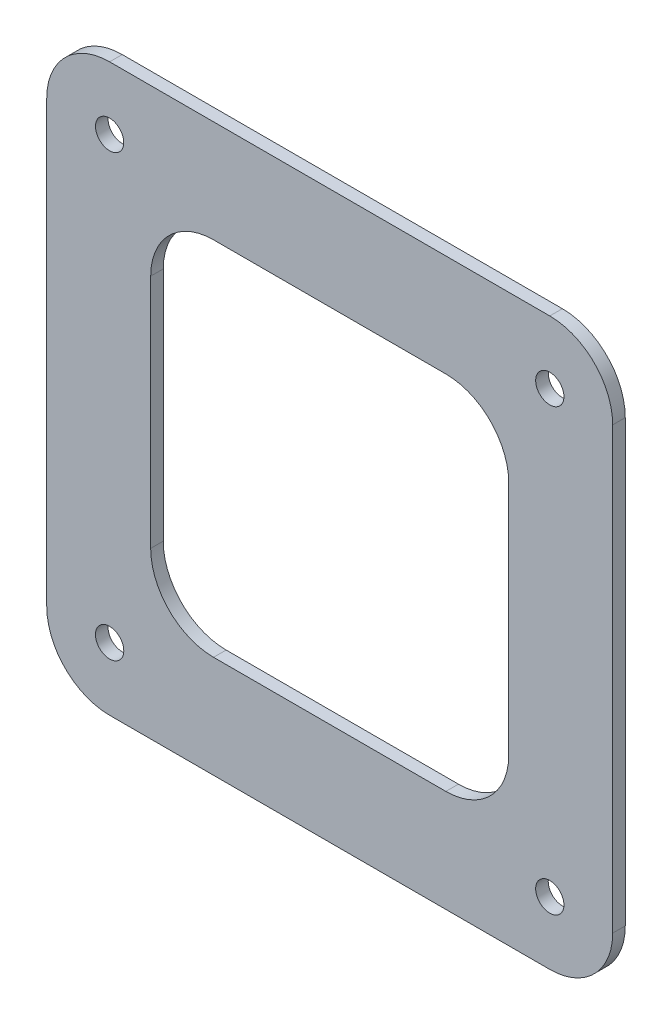
ISO-10303-21;
HEADER;
FILE_DESCRIPTION(('STEP AP214'),'2;1');
FILE_NAME('part.step','',(''),(''),'','','');
FILE_SCHEMA(('AUTOMOTIVE_DESIGN { 1 0 10303 214 1 1 1 1 }'));
ENDSEC;
DATA;
#1=APPLICATION_CONTEXT('core data for automotive mechanical design processes');
#2=APPLICATION_PROTOCOL_DEFINITION('international standard','automotive_design',2000,#1);
#3=PRODUCT_CONTEXT('',#1,'mechanical');
#4=PRODUCT('Part','Part','',(#3));
#5=PRODUCT_RELATED_PRODUCT_CATEGORY('part','',(#4));
#6=PRODUCT_DEFINITION_FORMATION('','',#4);
#7=PRODUCT_DEFINITION_CONTEXT('part definition',#1,'design');
#8=PRODUCT_DEFINITION('design','',#6,#7);
#9=PRODUCT_DEFINITION_SHAPE('','',#8);
#10=(LENGTH_UNIT() NAMED_UNIT(*) SI_UNIT(.MILLI.,.METRE.));
#11=(NAMED_UNIT(*) PLANE_ANGLE_UNIT() SI_UNIT($,.RADIAN.));
#12=(NAMED_UNIT(*) SI_UNIT($,.STERADIAN.) SOLID_ANGLE_UNIT());
#13=UNCERTAINTY_MEASURE_WITH_UNIT(LENGTH_MEASURE(1.E-05),#10,'distance_accuracy_value','');
#14=(GEOMETRIC_REPRESENTATION_CONTEXT(3) GLOBAL_UNCERTAINTY_ASSIGNED_CONTEXT((#13)) GLOBAL_UNIT_ASSIGNED_CONTEXT((#10,
#11,#12)) REPRESENTATION_CONTEXT('',''));
#15=CARTESIAN_POINT('',(0.,0.,0.));
#16=DIRECTION('',(0.,0.,1.));
#17=DIRECTION('',(1.,0.,0.));
#18=AXIS2_PLACEMENT_3D('',#15,#16,#17);
#19=CARTESIAN_POINT('',(35.,35.,2.));
#20=DIRECTION('',(0.,0.,-1.));
#21=DIRECTION('',(-1.,0.,0.));
#22=AXIS2_PLACEMENT_3D('',#19,#20,#21);
#23=CYLINDRICAL_SURFACE('',#22,10.);
#24=CARTESIAN_POINT('',(35.,35.,0.));
#25=DIRECTION('',(0.,0.,1.));
#26=DIRECTION('',(1.,0.,0.));
#27=AXIS2_PLACEMENT_3D('',#24,#25,#26);
#28=CIRCLE('',#27,10.);
#29=CARTESIAN_POINT('',(45.,34.9999999999999,0.));
#30=VERTEX_POINT('',#29);
#31=CARTESIAN_POINT('',(35.,45.,0.));
#32=VERTEX_POINT('',#31);
#33=EDGE_CURVE('E230',#30,#32,#28,.T.);
#34=ORIENTED_EDGE('',*,*,#33,.T.);
#35=DIRECTION('',(0.,0.,-1.));
#36=VECTOR('',#35,1.);
#37=CARTESIAN_POINT('',(35.,45.,2.));
#38=LINE('',#37,#36);
#39=CARTESIAN_POINT('',(35.,45.,2.));
#40=VERTEX_POINT('',#39);
#41=EDGE_CURVE('E11',#40,#32,#38,.T.);
#42=ORIENTED_EDGE('',*,*,#41,.F.);
#43=CARTESIAN_POINT('',(35.,35.,2.));
#44=DIRECTION('',(0.,0.,1.));
#45=DIRECTION('',(1.,0.,0.));
#46=AXIS2_PLACEMENT_3D('',#43,#44,#45);
#47=CIRCLE('',#46,10.);
#48=CARTESIAN_POINT('',(45.,34.9999999999999,2.));
#49=VERTEX_POINT('',#48);
#50=EDGE_CURVE('E233',#49,#40,#47,.T.);
#51=ORIENTED_EDGE('',*,*,#50,.F.);
#52=DIRECTION('',(0.,0.,-1.));
#53=VECTOR('',#52,1.);
#54=CARTESIAN_POINT('',(45.,34.9999999999999,2.));
#55=LINE('',#54,#53);
#56=EDGE_CURVE('E251',#49,#30,#55,.T.);
#57=ORIENTED_EDGE('',*,*,#56,.T.);
#58=EDGE_LOOP('',(#34,#42,#51,#57));
#59=FACE_BOUND('',#58,.T.);
#60=ADVANCED_FACE('F32',(#59),#23,.T.);
#61=CARTESIAN_POINT('',(35.,45.,2.));
#62=DIRECTION('',(0.,-1.,0.));
#63=DIRECTION('',(1.,0.,0.));
#64=AXIS2_PLACEMENT_3D('',#61,#62,#63);
#65=PLANE('',#64);
#66=DIRECTION('',(-1.,0.,0.));
#67=VECTOR('',#66,1.);
#68=CARTESIAN_POINT('',(35.,45.,0.));
#69=LINE('',#68,#67);
#70=CARTESIAN_POINT('',(-34.9999999999999,45.,0.));
#71=VERTEX_POINT('',#70);
#72=EDGE_CURVE('E254',#32,#71,#69,.T.);
#73=ORIENTED_EDGE('',*,*,#72,.T.);
#74=DIRECTION('',(0.,0.,-1.));
#75=VECTOR('',#74,1.);
#76=CARTESIAN_POINT('',(-34.9999999999999,45.,2.));
#77=LINE('',#76,#75);
#78=CARTESIAN_POINT('',(-34.9999999999999,45.,2.));
#79=VERTEX_POINT('',#78);
#80=EDGE_CURVE('E39',#79,#71,#77,.T.);
#81=ORIENTED_EDGE('',*,*,#80,.F.);
#82=DIRECTION('',(-1.,0.,0.));
#83=VECTOR('',#82,1.);
#84=CARTESIAN_POINT('',(35.,45.,2.));
#85=LINE('',#84,#83);
#86=EDGE_CURVE('E236',#40,#79,#85,.T.);
#87=ORIENTED_EDGE('',*,*,#86,.F.);
#88=ORIENTED_EDGE('',*,*,#41,.T.);
#89=EDGE_LOOP('',(#73,#81,#87,#88));
#90=FACE_BOUND('',#89,.T.);
#91=ADVANCED_FACE('F310',(#90),#65,.F.);
#92=CARTESIAN_POINT('',(-35.,35.,2.));
#93=DIRECTION('',(0.,0.,-1.));
#94=DIRECTION('',(-1.,0.,0.));
#95=AXIS2_PLACEMENT_3D('',#92,#93,#94);
#96=CYLINDRICAL_SURFACE('',#95,10.);
#97=CARTESIAN_POINT('',(-35.,35.,0.));
#98=DIRECTION('',(0.,0.,1.));
#99=DIRECTION('',(1.,0.,0.));
#100=AXIS2_PLACEMENT_3D('',#97,#98,#99);
#101=CIRCLE('',#100,10.);
#102=CARTESIAN_POINT('',(-45.,34.9999999999999,0.));
#103=VERTEX_POINT('',#102);
#104=EDGE_CURVE('E256',#71,#103,#101,.T.);
#105=ORIENTED_EDGE('',*,*,#104,.T.);
#106=DIRECTION('',(0.,0.,-1.));
#107=VECTOR('',#106,1.);
#108=CARTESIAN_POINT('',(-45.,34.9999999999999,2.));
#109=LINE('',#108,#107);
#110=CARTESIAN_POINT('',(-45.,34.9999999999999,2.));
#111=VERTEX_POINT('',#110);
#112=EDGE_CURVE('E281',#111,#103,#109,.T.);
#113=ORIENTED_EDGE('',*,*,#112,.F.);
#114=CARTESIAN_POINT('',(-35.,35.,2.));
#115=DIRECTION('',(0.,0.,1.));
#116=DIRECTION('',(1.,0.,0.));
#117=AXIS2_PLACEMENT_3D('',#114,#115,#116);
#118=CIRCLE('',#117,10.);
#119=EDGE_CURVE('E239',#79,#111,#118,.T.);
#120=ORIENTED_EDGE('',*,*,#119,.F.);
#121=ORIENTED_EDGE('',*,*,#80,.T.);
#122=EDGE_LOOP('',(#105,#113,#120,#121));
#123=FACE_BOUND('',#122,.T.);
#124=ADVANCED_FACE('F288',(#123),#96,.T.);
#125=CARTESIAN_POINT('',(-45.,-35.,2.));
#126=DIRECTION('',(1.,0.,0.));
#127=DIRECTION('',(0.,0.,-1.));
#128=AXIS2_PLACEMENT_3D('',#125,#126,#127);
#129=PLANE('',#128);
#130=DIRECTION('',(0.,-1.,0.));
#131=VECTOR('',#130,1.);
#132=CARTESIAN_POINT('',(-45.,-35.,0.));
#133=LINE('',#132,#131);
#134=CARTESIAN_POINT('',(-45.,-35.,0.));
#135=VERTEX_POINT('',#134);
#136=EDGE_CURVE('E258',#103,#135,#133,.T.);
#137=ORIENTED_EDGE('',*,*,#136,.T.);
#138=DIRECTION('',(0.,0.,-1.));
#139=VECTOR('',#138,1.);
#140=CARTESIAN_POINT('',(-45.,-35.,2.));
#141=LINE('',#140,#139);
#142=CARTESIAN_POINT('',(-45.,-35.,2.));
#143=VERTEX_POINT('',#142);
#144=EDGE_CURVE('E278',#143,#135,#141,.T.);
#145=ORIENTED_EDGE('',*,*,#144,.F.);
#146=DIRECTION('',(0.,-1.,0.));
#147=VECTOR('',#146,1.);
#148=CARTESIAN_POINT('',(-45.,-35.,2.));
#149=LINE('',#148,#147);
#150=EDGE_CURVE('E241',#111,#143,#149,.T.);
#151=ORIENTED_EDGE('',*,*,#150,.F.);
#152=ORIENTED_EDGE('',*,*,#112,.T.);
#153=EDGE_LOOP('',(#137,#145,#151,#152));
#154=FACE_BOUND('',#153,.T.);
#155=ADVANCED_FACE('F298',(#154),#129,.F.);
#156=CARTESIAN_POINT('',(-35.,-35.,2.));
#157=DIRECTION('',(0.,0.,-1.));
#158=DIRECTION('',(-1.,0.,0.));
#159=AXIS2_PLACEMENT_3D('',#156,#157,#158);
#160=CYLINDRICAL_SURFACE('',#159,10.);
#161=CARTESIAN_POINT('',(-35.,-35.,0.));
#162=DIRECTION('',(0.,0.,1.));
#163=DIRECTION('',(-1.,0.,0.));
#164=AXIS2_PLACEMENT_3D('',#161,#162,#163);
#165=CIRCLE('',#164,10.);
#166=CARTESIAN_POINT('',(-34.9999999999999,-45.,0.));
#167=VERTEX_POINT('',#166);
#168=EDGE_CURVE('E260',#135,#167,#165,.T.);
#169=ORIENTED_EDGE('',*,*,#168,.T.);
#170=DIRECTION('',(0.,0.,-1.));
#171=VECTOR('',#170,1.);
#172=CARTESIAN_POINT('',(-34.9999999999999,-45.,2.));
#173=LINE('',#172,#171);
#174=CARTESIAN_POINT('',(-34.9999999999999,-45.,2.));
#175=VERTEX_POINT('',#174);
#176=EDGE_CURVE('E275',#175,#167,#173,.T.);
#177=ORIENTED_EDGE('',*,*,#176,.F.);
#178=CARTESIAN_POINT('',(-35.,-35.,2.));
#179=DIRECTION('',(0.,0.,1.));
#180=DIRECTION('',(-1.,0.,0.));
#181=AXIS2_PLACEMENT_3D('',#178,#179,#180);
#182=CIRCLE('',#181,10.);
#183=EDGE_CURVE('E243',#143,#175,#182,.T.);
#184=ORIENTED_EDGE('',*,*,#183,.F.);
#185=ORIENTED_EDGE('',*,*,#144,.T.);
#186=EDGE_LOOP('',(#169,#177,#184,#185));
#187=FACE_BOUND('',#186,.T.);
#188=ADVANCED_FACE('F302',(#187),#160,.T.);
#189=CARTESIAN_POINT('',(35.,-45.,2.));
#190=DIRECTION('',(0.,1.,0.));
#191=DIRECTION('',(-1.,0.,0.));
#192=AXIS2_PLACEMENT_3D('',#189,#190,#191);
#193=PLANE('',#192);
#194=DIRECTION('',(1.,0.,0.));
#195=VECTOR('',#194,1.);
#196=CARTESIAN_POINT('',(35.,-45.,0.));
#197=LINE('',#196,#195);
#198=CARTESIAN_POINT('',(35.,-45.,0.));
#199=VERTEX_POINT('',#198);
#200=EDGE_CURVE('E262',#167,#199,#197,.T.);
#201=ORIENTED_EDGE('',*,*,#200,.T.);
#202=DIRECTION('',(0.,0.,-1.));
#203=VECTOR('',#202,1.);
#204=CARTESIAN_POINT('',(35.,-45.,2.));
#205=LINE('',#204,#203);
#206=CARTESIAN_POINT('',(35.,-45.,2.));
#207=VERTEX_POINT('',#206);
#208=EDGE_CURVE('E272',#207,#199,#205,.T.);
#209=ORIENTED_EDGE('',*,*,#208,.F.);
#210=DIRECTION('',(1.,0.,0.));
#211=VECTOR('',#210,1.);
#212=CARTESIAN_POINT('',(35.,-45.,2.));
#213=LINE('',#212,#211);
#214=EDGE_CURVE('E245',#175,#207,#213,.T.);
#215=ORIENTED_EDGE('',*,*,#214,.F.);
#216=ORIENTED_EDGE('',*,*,#176,.T.);
#217=EDGE_LOOP('',(#201,#209,#215,#216));
#218=FACE_BOUND('',#217,.T.);
#219=ADVANCED_FACE('F323',(#218),#193,.F.);
#220=CARTESIAN_POINT('',(35.,-35.,2.));
#221=DIRECTION('',(0.,0.,-1.));
#222=DIRECTION('',(-1.,0.,0.));
#223=AXIS2_PLACEMENT_3D('',#220,#221,#222);
#224=CYLINDRICAL_SURFACE('',#223,10.);
#225=CARTESIAN_POINT('',(35.,-35.,0.));
#226=DIRECTION('',(0.,0.,1.));
#227=DIRECTION('',(-1.,0.,0.));
#228=AXIS2_PLACEMENT_3D('',#225,#226,#227);
#229=CIRCLE('',#228,10.);
#230=CARTESIAN_POINT('',(45.,-34.9999999999999,0.));
#231=VERTEX_POINT('',#230);
#232=EDGE_CURVE('E264',#199,#231,#229,.T.);
#233=ORIENTED_EDGE('',*,*,#232,.T.);
#234=DIRECTION('',(0.,0.,-1.));
#235=VECTOR('',#234,1.);
#236=CARTESIAN_POINT('',(45.,-34.9999999999999,2.));
#237=LINE('',#236,#235);
#238=CARTESIAN_POINT('',(45.,-34.9999999999999,2.));
#239=VERTEX_POINT('',#238);
#240=EDGE_CURVE('E269',#239,#231,#237,.T.);
#241=ORIENTED_EDGE('',*,*,#240,.F.);
#242=CARTESIAN_POINT('',(35.,-35.,2.));
#243=DIRECTION('',(0.,0.,1.));
#244=DIRECTION('',(-1.,0.,0.));
#245=AXIS2_PLACEMENT_3D('',#242,#243,#244);
#246=CIRCLE('',#245,10.);
#247=EDGE_CURVE('E247',#207,#239,#246,.T.);
#248=ORIENTED_EDGE('',*,*,#247,.F.);
#249=ORIENTED_EDGE('',*,*,#208,.T.);
#250=EDGE_LOOP('',(#233,#241,#248,#249));
#251=FACE_BOUND('',#250,.T.);
#252=ADVANCED_FACE('F321',(#251),#224,.T.);
#253=CARTESIAN_POINT('',(45.,-34.9999999999999,2.));
#254=DIRECTION('',(-1.,0.,0.));
#255=DIRECTION('',(0.,0.,1.));
#256=AXIS2_PLACEMENT_3D('',#253,#254,#255);
#257=PLANE('',#256);
#258=DIRECTION('',(0.,1.,0.));
#259=VECTOR('',#258,1.);
#260=CARTESIAN_POINT('',(45.,-34.9999999999999,0.));
#261=LINE('',#260,#259);
#262=EDGE_CURVE('E237',#231,#30,#261,.T.);
#263=ORIENTED_EDGE('',*,*,#262,.T.);
#264=ORIENTED_EDGE('',*,*,#56,.F.);
#265=DIRECTION('',(0.,1.,0.));
#266=VECTOR('',#265,1.);
#267=CARTESIAN_POINT('',(45.,-34.9999999999999,2.));
#268=LINE('',#267,#266);
#269=EDGE_CURVE('E249',#239,#49,#268,.T.);
#270=ORIENTED_EDGE('',*,*,#269,.F.);
#271=ORIENTED_EDGE('',*,*,#240,.T.);
#272=EDGE_LOOP('',(#263,#264,#270,#271));
#273=FACE_BOUND('',#272,.T.);
#274=ADVANCED_FACE('F316',(#273),#257,.F.);
#275=CARTESIAN_POINT('',(35.,35.,2.));
#276=DIRECTION('',(0.,0.,1.));
#277=DIRECTION('',(1.,0.,0.));
#278=AXIS2_PLACEMENT_3D('',#275,#276,#277);
#279=PLANE('',#278);
#280=CARTESIAN_POINT('',(-18.4714638136957,18.7452278888274,2.));
#281=DIRECTION('',(0.,0.,1.));
#282=DIRECTION('',(1.,0.,0.));
#283=AXIS2_PLACEMENT_3D('',#280,#281,#282);
#284=CIRCLE('',#283,10.);
#285=CARTESIAN_POINT('',(-18.4714638136956,28.7452278888274,2.));
#286=VERTEX_POINT('',#285);
#287=CARTESIAN_POINT('',(-28.4714638136957,18.7452278888273,2.));
#288=VERTEX_POINT('',#287);
#289=EDGE_CURVE('E206',#286,#288,#284,.T.);
#290=ORIENTED_EDGE('',*,*,#289,.F.);
#291=DIRECTION('',(-1.,0.,0.));
#292=VECTOR('',#291,1.);
#293=CARTESIAN_POINT('',(35.,28.7452278888274,2.));
#294=LINE('',#293,#292);
#295=CARTESIAN_POINT('',(18.4714638136956,28.7452278888274,2.));
#296=VERTEX_POINT('',#295);
#297=EDGE_CURVE('E183',#296,#286,#294,.T.);
#298=ORIENTED_EDGE('',*,*,#297,.F.);
#299=CARTESIAN_POINT('',(18.4714638136957,18.7452278888274,2.));
#300=DIRECTION('',(0.,0.,1.));
#301=DIRECTION('',(1.,0.,0.));
#302=AXIS2_PLACEMENT_3D('',#299,#300,#301);
#303=CIRCLE('',#302,10.);
#304=CARTESIAN_POINT('',(28.4714638136957,18.7452278888273,2.));
#305=VERTEX_POINT('',#304);
#306=EDGE_CURVE('E150',#305,#296,#303,.T.);
#307=ORIENTED_EDGE('',*,*,#306,.F.);
#308=DIRECTION('',(0.,1.,0.));
#309=VECTOR('',#308,1.);
#310=CARTESIAN_POINT('',(28.4714638136957,35.,2.));
#311=LINE('',#310,#309);
#312=CARTESIAN_POINT('',(28.4714638136957,-18.7452278888273,2.));
#313=VERTEX_POINT('',#312);
#314=EDGE_CURVE('E196',#313,#305,#311,.T.);
#315=ORIENTED_EDGE('',*,*,#314,.F.);
#316=CARTESIAN_POINT('',(18.4714638136957,-18.7452278888274,2.));
#317=DIRECTION('',(0.,0.,1.));
#318=DIRECTION('',(1.,0.,0.));
#319=AXIS2_PLACEMENT_3D('',#316,#317,#318);
#320=CIRCLE('',#319,10.);
#321=CARTESIAN_POINT('',(18.4714638136956,-28.7452278888274,2.));
#322=VERTEX_POINT('',#321);
#323=EDGE_CURVE('E198',#322,#313,#320,.T.);
#324=ORIENTED_EDGE('',*,*,#323,.F.);
#325=DIRECTION('',(1.,0.,0.));
#326=VECTOR('',#325,1.);
#327=CARTESIAN_POINT('',(35.,-28.7452278888274,2.));
#328=LINE('',#327,#326);
#329=CARTESIAN_POINT('',(-18.4714638136956,-28.7452278888274,2.));
#330=VERTEX_POINT('',#329);
#331=EDGE_CURVE('E200',#330,#322,#328,.T.);
#332=ORIENTED_EDGE('',*,*,#331,.F.);
#333=CARTESIAN_POINT('',(-18.4714638136957,-18.7452278888274,2.));
#334=DIRECTION('',(0.,0.,1.));
#335=DIRECTION('',(1.,0.,0.));
#336=AXIS2_PLACEMENT_3D('',#333,#334,#335);
#337=CIRCLE('',#336,10.);
#338=CARTESIAN_POINT('',(-28.4714638136957,-18.7452278888273,2.));
#339=VERTEX_POINT('',#338);
#340=EDGE_CURVE('E202',#339,#330,#337,.T.);
#341=ORIENTED_EDGE('',*,*,#340,.F.);
#342=DIRECTION('',(0.,-1.,0.));
#343=VECTOR('',#342,1.);
#344=CARTESIAN_POINT('',(-28.4714638136957,35.,2.));
#345=LINE('',#344,#343);
#346=EDGE_CURVE('E204',#288,#339,#345,.T.);
#347=ORIENTED_EDGE('',*,*,#346,.F.);
#348=EDGE_LOOP('',(#290,#298,#307,#315,#324,#332,#341,#347));
#349=FACE_BOUND('',#348,.T.);
#350=CARTESIAN_POINT('',(-35.,35.,2.));
#351=DIRECTION('',(0.,0.,-1.));
#352=DIRECTION('',(-1.,0.,0.));
#353=AXIS2_PLACEMENT_3D('',#350,#351,#352);
#354=CIRCLE('',#353,2.25);
#355=CARTESIAN_POINT('',(-37.25,35.,2.));
#356=VERTEX_POINT('',#355);
#357=EDGE_CURVE('E209',#356,#356,#354,.T.);
#358=ORIENTED_EDGE('',*,*,#357,.T.);
#359=EDGE_LOOP('',(#358));
#360=FACE_BOUND('',#359,.T.);
#361=CARTESIAN_POINT('',(-35.,-35.,2.));
#362=DIRECTION('',(0.,0.,-1.));
#363=DIRECTION('',(1.,0.,0.));
#364=AXIS2_PLACEMENT_3D('',#361,#362,#363);
#365=CIRCLE('',#364,2.25);
#366=CARTESIAN_POINT('',(-32.75,-35.,2.));
#367=VERTEX_POINT('',#366);
#368=EDGE_CURVE('E215',#367,#367,#365,.T.);
#369=ORIENTED_EDGE('',*,*,#368,.T.);
#370=EDGE_LOOP('',(#369));
#371=FACE_BOUND('',#370,.T.);
#372=CARTESIAN_POINT('',(35.,35.,2.));
#373=DIRECTION('',(0.,0.,-1.));
#374=DIRECTION('',(1.,0.,0.));
#375=AXIS2_PLACEMENT_3D('',#372,#373,#374);
#376=CIRCLE('',#375,2.25);
#377=CARTESIAN_POINT('',(37.25,35.,2.));
#378=VERTEX_POINT('',#377);
#379=EDGE_CURVE('E221',#378,#378,#376,.T.);
#380=ORIENTED_EDGE('',*,*,#379,.T.);
#381=EDGE_LOOP('',(#380));
#382=FACE_BOUND('',#381,.T.);
#383=CARTESIAN_POINT('',(35.,-35.,2.));
#384=DIRECTION('',(0.,0.,-1.));
#385=DIRECTION('',(-1.,0.,0.));
#386=AXIS2_PLACEMENT_3D('',#383,#384,#385);
#387=CIRCLE('',#386,2.25);
#388=CARTESIAN_POINT('',(32.75,-35.,2.));
#389=VERTEX_POINT('',#388);
#390=EDGE_CURVE('E227',#389,#389,#387,.T.);
#391=ORIENTED_EDGE('',*,*,#390,.T.);
#392=EDGE_LOOP('',(#391));
#393=FACE_BOUND('',#392,.T.);
#394=ORIENTED_EDGE('',*,*,#50,.T.);
#395=ORIENTED_EDGE('',*,*,#86,.T.);
#396=ORIENTED_EDGE('',*,*,#119,.T.);
#397=ORIENTED_EDGE('',*,*,#150,.T.);
#398=ORIENTED_EDGE('',*,*,#183,.T.);
#399=ORIENTED_EDGE('',*,*,#214,.T.);
#400=ORIENTED_EDGE('',*,*,#247,.T.);
#401=ORIENTED_EDGE('',*,*,#269,.T.);
#402=EDGE_LOOP('',(#394,#395,#396,#397,#398,#399,#400,#401));
#403=FACE_BOUND('',#402,.T.);
#404=ADVANCED_FACE('F306',(#349,#360,#371,#382,#393,#403),#279,.T.);
#405=CARTESIAN_POINT('',(35.,35.,0.));
#406=DIRECTION('',(0.,0.,1.));
#407=DIRECTION('',(1.,0.,0.));
#408=AXIS2_PLACEMENT_3D('',#405,#406,#407);
#409=PLANE('',#408);
#410=DIRECTION('',(1.,0.,0.));
#411=VECTOR('',#410,1.);
#412=CARTESIAN_POINT('',(18.4714638136956,28.7452278888274,0.));
#413=LINE('',#412,#411);
#414=CARTESIAN_POINT('',(-18.4714638136956,28.7452278888274,0.));
#415=VERTEX_POINT('',#414);
#416=CARTESIAN_POINT('',(18.4714638136956,28.7452278888274,0.));
#417=VERTEX_POINT('',#416);
#418=EDGE_CURVE('E156',#415,#417,#413,.T.);
#419=ORIENTED_EDGE('',*,*,#418,.F.);
#420=CARTESIAN_POINT('',(-18.4714638136957,18.7452278888274,0.));
#421=DIRECTION('',(0.,0.,-1.));
#422=DIRECTION('',(1.,0.,0.));
#423=AXIS2_PLACEMENT_3D('',#420,#421,#422);
#424=CIRCLE('',#423,10.);
#425=CARTESIAN_POINT('',(-28.4714638136957,18.7452278888273,0.));
#426=VERTEX_POINT('',#425);
#427=EDGE_CURVE('E54',#426,#415,#424,.T.);
#428=ORIENTED_EDGE('',*,*,#427,.F.);
#429=DIRECTION('',(0.,1.,0.));
#430=VECTOR('',#429,1.);
#431=CARTESIAN_POINT('',(-28.4714638136957,-18.7452278888273,0.));
#432=LINE('',#431,#430);
#433=CARTESIAN_POINT('',(-28.4714638136957,-18.7452278888273,0.));
#434=VERTEX_POINT('',#433);
#435=EDGE_CURVE('E178',#434,#426,#432,.T.);
#436=ORIENTED_EDGE('',*,*,#435,.F.);
#437=CARTESIAN_POINT('',(-18.4714638136957,-18.7452278888274,0.));
#438=DIRECTION('',(0.,0.,-1.));
#439=DIRECTION('',(-1.,0.,0.));
#440=AXIS2_PLACEMENT_3D('',#437,#438,#439);
#441=CIRCLE('',#440,10.);
#442=CARTESIAN_POINT('',(-18.4714638136956,-28.7452278888274,0.));
#443=VERTEX_POINT('',#442);
#444=EDGE_CURVE('E175',#443,#434,#441,.T.);
#445=ORIENTED_EDGE('',*,*,#444,.F.);
#446=DIRECTION('',(-1.,0.,0.));
#447=VECTOR('',#446,1.);
#448=CARTESIAN_POINT('',(18.4714638136956,-28.7452278888274,0.));
#449=LINE('',#448,#447);
#450=CARTESIAN_POINT('',(18.4714638136956,-28.7452278888274,0.));
#451=VERTEX_POINT('',#450);
#452=EDGE_CURVE('E172',#451,#443,#449,.T.);
#453=ORIENTED_EDGE('',*,*,#452,.F.);
#454=CARTESIAN_POINT('',(18.4714638136957,-18.7452278888274,0.));
#455=DIRECTION('',(0.,0.,-1.));
#456=DIRECTION('',(1.,0.,0.));
#457=AXIS2_PLACEMENT_3D('',#454,#455,#456);
#458=CIRCLE('',#457,10.);
#459=CARTESIAN_POINT('',(28.4714638136957,-18.7452278888273,0.));
#460=VERTEX_POINT('',#459);
#461=EDGE_CURVE('E166',#460,#451,#458,.T.);
#462=ORIENTED_EDGE('',*,*,#461,.F.);
#463=DIRECTION('',(0.,-1.,0.));
#464=VECTOR('',#463,1.);
#465=CARTESIAN_POINT('',(28.4714638136957,-18.7452278888273,0.));
#466=LINE('',#465,#464);
#467=CARTESIAN_POINT('',(28.4714638136957,18.7452278888273,0.));
#468=VERTEX_POINT('',#467);
#469=EDGE_CURVE('E164',#468,#460,#466,.T.);
#470=ORIENTED_EDGE('',*,*,#469,.F.);
#471=CARTESIAN_POINT('',(18.4714638136957,18.7452278888274,0.));
#472=DIRECTION('',(0.,0.,-1.));
#473=DIRECTION('',(1.,0.,0.));
#474=AXIS2_PLACEMENT_3D('',#471,#472,#473);
#475=CIRCLE('',#474,10.);
#476=EDGE_CURVE('E147',#417,#468,#475,.T.);
#477=ORIENTED_EDGE('',*,*,#476,.F.);
#478=EDGE_LOOP('',(#419,#428,#436,#445,#453,#462,#470,#477));
#479=FACE_BOUND('',#478,.T.);
#480=CARTESIAN_POINT('',(-35.,35.,0.));
#481=DIRECTION('',(0.,0.,-1.));
#482=DIRECTION('',(-1.,0.,0.));
#483=AXIS2_PLACEMENT_3D('',#480,#481,#482);
#484=CIRCLE('',#483,2.25);
#485=CARTESIAN_POINT('',(-37.25,35.,0.));
#486=VERTEX_POINT('',#485);
#487=EDGE_CURVE('E208',#486,#486,#484,.T.);
#488=ORIENTED_EDGE('',*,*,#487,.F.);
#489=EDGE_LOOP('',(#488));
#490=FACE_BOUND('',#489,.T.);
#491=CARTESIAN_POINT('',(-35.,-35.,0.));
#492=DIRECTION('',(0.,0.,-1.));
#493=DIRECTION('',(1.,0.,0.));
#494=AXIS2_PLACEMENT_3D('',#491,#492,#493);
#495=CIRCLE('',#494,2.25);
#496=CARTESIAN_POINT('',(-32.75,-35.,0.));
#497=VERTEX_POINT('',#496);
#498=EDGE_CURVE('E212',#497,#497,#495,.T.);
#499=ORIENTED_EDGE('',*,*,#498,.F.);
#500=EDGE_LOOP('',(#499));
#501=FACE_BOUND('',#500,.T.);
#502=CARTESIAN_POINT('',(35.,35.,0.));
#503=DIRECTION('',(0.,0.,-1.));
#504=DIRECTION('',(1.,0.,0.));
#505=AXIS2_PLACEMENT_3D('',#502,#503,#504);
#506=CIRCLE('',#505,2.25);
#507=CARTESIAN_POINT('',(37.25,35.,0.));
#508=VERTEX_POINT('',#507);
#509=EDGE_CURVE('E218',#508,#508,#506,.T.);
#510=ORIENTED_EDGE('',*,*,#509,.F.);
#511=EDGE_LOOP('',(#510));
#512=FACE_BOUND('',#511,.T.);
#513=CARTESIAN_POINT('',(35.,-35.,0.));
#514=DIRECTION('',(0.,0.,-1.));
#515=DIRECTION('',(-1.,0.,0.));
#516=AXIS2_PLACEMENT_3D('',#513,#514,#515);
#517=CIRCLE('',#516,2.25);
#518=CARTESIAN_POINT('',(32.75,-35.,0.));
#519=VERTEX_POINT('',#518);
#520=EDGE_CURVE('E224',#519,#519,#517,.T.);
#521=ORIENTED_EDGE('',*,*,#520,.F.);
#522=EDGE_LOOP('',(#521));
#523=FACE_BOUND('',#522,.T.);
#524=ORIENTED_EDGE('',*,*,#33,.F.);
#525=ORIENTED_EDGE('',*,*,#262,.F.);
#526=ORIENTED_EDGE('',*,*,#232,.F.);
#527=ORIENTED_EDGE('',*,*,#200,.F.);
#528=ORIENTED_EDGE('',*,*,#168,.F.);
#529=ORIENTED_EDGE('',*,*,#136,.F.);
#530=ORIENTED_EDGE('',*,*,#104,.F.);
#531=ORIENTED_EDGE('',*,*,#72,.F.);
#532=EDGE_LOOP('',(#524,#525,#526,#527,#528,#529,#530,#531));
#533=FACE_BOUND('',#532,.T.);
#534=ADVANCED_FACE('F160',(#479,#490,#501,#512,#523,#533),#409,.F.);
#535=CARTESIAN_POINT('',(35.,-35.,2.));
#536=DIRECTION('',(0.,0.,-1.));
#537=DIRECTION('',(-1.,0.,0.));
#538=AXIS2_PLACEMENT_3D('',#535,#536,#537);
#539=CYLINDRICAL_SURFACE('',#538,2.25);
#540=ORIENTED_EDGE('',*,*,#390,.F.);
#541=EDGE_LOOP('',(#540));
#542=FACE_BOUND('',#541,.T.);
#543=ORIENTED_EDGE('',*,*,#520,.T.);
#544=EDGE_LOOP('',(#543));
#545=FACE_BOUND('',#544,.T.);
#546=ADVANCED_FACE('F375',(#542,#545),#539,.F.);
#547=CARTESIAN_POINT('',(35.,35.,2.));
#548=DIRECTION('',(0.,0.,-1.));
#549=DIRECTION('',(-1.,0.,0.));
#550=AXIS2_PLACEMENT_3D('',#547,#548,#549);
#551=CYLINDRICAL_SURFACE('',#550,2.25);
#552=ORIENTED_EDGE('',*,*,#379,.F.);
#553=EDGE_LOOP('',(#552));
#554=FACE_BOUND('',#553,.T.);
#555=ORIENTED_EDGE('',*,*,#509,.T.);
#556=EDGE_LOOP('',(#555));
#557=FACE_BOUND('',#556,.T.);
#558=ADVANCED_FACE('F380',(#554,#557),#551,.F.);
#559=CARTESIAN_POINT('',(-35.,-35.,2.));
#560=DIRECTION('',(0.,0.,-1.));
#561=DIRECTION('',(-1.,0.,0.));
#562=AXIS2_PLACEMENT_3D('',#559,#560,#561);
#563=CYLINDRICAL_SURFACE('',#562,2.25);
#564=ORIENTED_EDGE('',*,*,#368,.F.);
#565=EDGE_LOOP('',(#564));
#566=FACE_BOUND('',#565,.T.);
#567=ORIENTED_EDGE('',*,*,#498,.T.);
#568=EDGE_LOOP('',(#567));
#569=FACE_BOUND('',#568,.T.);
#570=ADVANCED_FACE('F392',(#566,#569),#563,.F.);
#571=CARTESIAN_POINT('',(-35.,35.,2.));
#572=DIRECTION('',(0.,0.,-1.));
#573=DIRECTION('',(-1.,0.,0.));
#574=AXIS2_PLACEMENT_3D('',#571,#572,#573);
#575=CYLINDRICAL_SURFACE('',#574,2.25);
#576=ORIENTED_EDGE('',*,*,#357,.F.);
#577=EDGE_LOOP('',(#576));
#578=FACE_BOUND('',#577,.T.);
#579=ORIENTED_EDGE('',*,*,#487,.T.);
#580=EDGE_LOOP('',(#579));
#581=FACE_BOUND('',#580,.T.);
#582=ADVANCED_FACE('F402',(#578,#581),#575,.F.);
#583=CARTESIAN_POINT('',(-18.4714638136957,18.7452278888274,10.));
#584=DIRECTION('',(0.,0.,-1.));
#585=DIRECTION('',(-1.,0.,0.));
#586=AXIS2_PLACEMENT_3D('',#583,#584,#585);
#587=CYLINDRICAL_SURFACE('',#586,10.);
#588=ORIENTED_EDGE('',*,*,#289,.T.);
#589=DIRECTION('',(0.,0.,-1.));
#590=VECTOR('',#589,1.);
#591=CARTESIAN_POINT('',(-28.4714638136957,18.7452278888273,10.));
#592=LINE('',#591,#590);
#593=EDGE_CURVE('E181',#288,#426,#592,.T.);
#594=ORIENTED_EDGE('',*,*,#593,.T.);
#595=ORIENTED_EDGE('',*,*,#427,.T.);
#596=DIRECTION('',(0.,0.,-1.));
#597=VECTOR('',#596,1.);
#598=CARTESIAN_POINT('',(-18.4714638136956,28.7452278888274,10.));
#599=LINE('',#598,#597);
#600=EDGE_CURVE('E153',#286,#415,#599,.T.);
#601=ORIENTED_EDGE('',*,*,#600,.F.);
#602=EDGE_LOOP('',(#588,#594,#595,#601));
#603=FACE_BOUND('',#602,.T.);
#604=ADVANCED_FACE('F412',(#603),#587,.F.);
#605=CARTESIAN_POINT('',(-28.4714638136957,-18.7452278888273,10.));
#606=DIRECTION('',(-1.,0.,0.));
#607=DIRECTION('',(0.,0.,1.));
#608=AXIS2_PLACEMENT_3D('',#605,#606,#607);
#609=PLANE('',#608);
#610=ORIENTED_EDGE('',*,*,#346,.T.);
#611=DIRECTION('',(0.,0.,-1.));
#612=VECTOR('',#611,1.);
#613=CARTESIAN_POINT('',(-28.4714638136957,-18.7452278888273,10.));
#614=LINE('',#613,#612);
#615=EDGE_CURVE('E184',#339,#434,#614,.T.);
#616=ORIENTED_EDGE('',*,*,#615,.T.);
#617=ORIENTED_EDGE('',*,*,#435,.T.);
#618=ORIENTED_EDGE('',*,*,#593,.F.);
#619=EDGE_LOOP('',(#610,#616,#617,#618));
#620=FACE_BOUND('',#619,.T.);
#621=ADVANCED_FACE('F435',(#620),#609,.F.);
#622=CARTESIAN_POINT('',(-18.4714638136957,-18.7452278888274,10.));
#623=DIRECTION('',(0.,0.,-1.));
#624=DIRECTION('',(-1.,0.,0.));
#625=AXIS2_PLACEMENT_3D('',#622,#623,#624);
#626=CYLINDRICAL_SURFACE('',#625,10.);
#627=ORIENTED_EDGE('',*,*,#340,.T.);
#628=DIRECTION('',(0.,0.,-1.));
#629=VECTOR('',#628,1.);
#630=CARTESIAN_POINT('',(-18.4714638136956,-28.7452278888274,10.));
#631=LINE('',#630,#629);
#632=EDGE_CURVE('E186',#330,#443,#631,.T.);
#633=ORIENTED_EDGE('',*,*,#632,.T.);
#634=ORIENTED_EDGE('',*,*,#444,.T.);
#635=ORIENTED_EDGE('',*,*,#615,.F.);
#636=EDGE_LOOP('',(#627,#633,#634,#635));
#637=FACE_BOUND('',#636,.T.);
#638=ADVANCED_FACE('F444',(#637),#626,.F.);
#639=CARTESIAN_POINT('',(18.4714638136956,-28.7452278888274,10.));
#640=DIRECTION('',(0.,-1.,0.));
#641=DIRECTION('',(0.,0.,-1.));
#642=AXIS2_PLACEMENT_3D('',#639,#640,#641);
#643=PLANE('',#642);
#644=ORIENTED_EDGE('',*,*,#331,.T.);
#645=DIRECTION('',(0.,0.,-1.));
#646=VECTOR('',#645,1.);
#647=CARTESIAN_POINT('',(18.4714638136956,-28.7452278888274,10.));
#648=LINE('',#647,#646);
#649=EDGE_CURVE('E188',#322,#451,#648,.T.);
#650=ORIENTED_EDGE('',*,*,#649,.T.);
#651=ORIENTED_EDGE('',*,*,#452,.T.);
#652=ORIENTED_EDGE('',*,*,#632,.F.);
#653=EDGE_LOOP('',(#644,#650,#651,#652));
#654=FACE_BOUND('',#653,.T.);
#655=ADVANCED_FACE('F454',(#654),#643,.F.);
#656=CARTESIAN_POINT('',(18.4714638136957,-18.7452278888274,10.));
#657=DIRECTION('',(0.,0.,-1.));
#658=DIRECTION('',(-1.,0.,0.));
#659=AXIS2_PLACEMENT_3D('',#656,#657,#658);
#660=CYLINDRICAL_SURFACE('',#659,10.);
#661=ORIENTED_EDGE('',*,*,#323,.T.);
#662=DIRECTION('',(0.,0.,-1.));
#663=VECTOR('',#662,1.);
#664=CARTESIAN_POINT('',(28.4714638136957,-18.7452278888273,10.));
#665=LINE('',#664,#663);
#666=EDGE_CURVE('E190',#313,#460,#665,.T.);
#667=ORIENTED_EDGE('',*,*,#666,.T.);
#668=ORIENTED_EDGE('',*,*,#461,.T.);
#669=ORIENTED_EDGE('',*,*,#649,.F.);
#670=EDGE_LOOP('',(#661,#667,#668,#669));
#671=FACE_BOUND('',#670,.T.);
#672=ADVANCED_FACE('F464',(#671),#660,.F.);
#673=CARTESIAN_POINT('',(28.4714638136957,-18.7452278888273,10.));
#674=DIRECTION('',(1.,0.,0.));
#675=DIRECTION('',(0.,0.,-1.));
#676=AXIS2_PLACEMENT_3D('',#673,#674,#675);
#677=PLANE('',#676);
#678=ORIENTED_EDGE('',*,*,#314,.T.);
#679=DIRECTION('',(0.,0.,-1.));
#680=VECTOR('',#679,1.);
#681=CARTESIAN_POINT('',(28.4714638136957,18.7452278888273,10.));
#682=LINE('',#681,#680);
#683=EDGE_CURVE('E152',#305,#468,#682,.T.);
#684=ORIENTED_EDGE('',*,*,#683,.T.);
#685=ORIENTED_EDGE('',*,*,#469,.T.);
#686=ORIENTED_EDGE('',*,*,#666,.F.);
#687=EDGE_LOOP('',(#678,#684,#685,#686));
#688=FACE_BOUND('',#687,.T.);
#689=ADVANCED_FACE('F474',(#688),#677,.F.);
#690=CARTESIAN_POINT('',(18.4714638136957,18.7452278888274,10.));
#691=DIRECTION('',(0.,0.,-1.));
#692=DIRECTION('',(-1.,0.,0.));
#693=AXIS2_PLACEMENT_3D('',#690,#691,#692);
#694=CYLINDRICAL_SURFACE('',#693,10.);
#695=ORIENTED_EDGE('',*,*,#306,.T.);
#696=DIRECTION('',(0.,0.,-1.));
#697=VECTOR('',#696,1.);
#698=CARTESIAN_POINT('',(18.4714638136956,28.7452278888274,10.));
#699=LINE('',#698,#697);
#700=EDGE_CURVE('E46',#296,#417,#699,.T.);
#701=ORIENTED_EDGE('',*,*,#700,.T.);
#702=ORIENTED_EDGE('',*,*,#476,.T.);
#703=ORIENTED_EDGE('',*,*,#683,.F.);
#704=EDGE_LOOP('',(#695,#701,#702,#703));
#705=FACE_BOUND('',#704,.T.);
#706=ADVANCED_FACE('F144',(#705),#694,.F.);
#707=CARTESIAN_POINT('',(18.4714638136956,28.7452278888274,10.));
#708=DIRECTION('',(0.,1.,0.));
#709=DIRECTION('',(0.,0.,1.));
#710=AXIS2_PLACEMENT_3D('',#707,#708,#709);
#711=PLANE('',#710);
#712=ORIENTED_EDGE('',*,*,#297,.T.);
#713=ORIENTED_EDGE('',*,*,#600,.T.);
#714=ORIENTED_EDGE('',*,*,#418,.T.);
#715=ORIENTED_EDGE('',*,*,#700,.F.);
#716=EDGE_LOOP('',(#712,#713,#714,#715));
#717=FACE_BOUND('',#716,.T.);
#718=ADVANCED_FACE('F157',(#717),#711,.F.);
#719=CLOSED_SHELL('',(#60,#91,#124,#155,#188,#219,#252,#274,#404,#534,#546,#558,#570,#582,#604,
#621,#638,#655,#672,#689,#706,#718));
#720=MANIFOLD_SOLID_BREP('B2',#719);
#721=ADVANCED_BREP_SHAPE_REPRESENTATION('',(#18,#720),#14);
#722=SHAPE_DEFINITION_REPRESENTATION(#9,#721);
ENDSEC;
END-ISO-10303-21;
